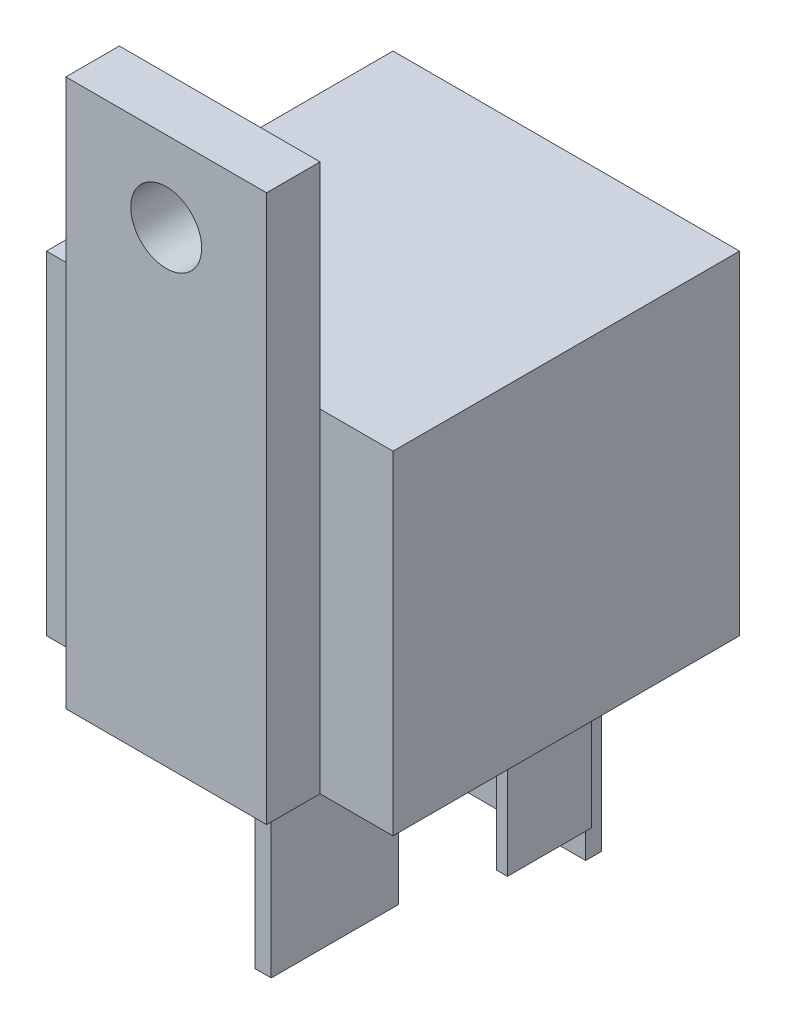
ISO-10303-21;
HEADER;
FILE_DESCRIPTION(('STEP AP214'),'2;1');
FILE_NAME('part.step','',(''),(''),'','','');
FILE_SCHEMA(('AUTOMOTIVE_DESIGN { 1 0 10303 214 1 1 1 1 }'));
ENDSEC;
DATA;
#1=APPLICATION_CONTEXT('core data for automotive mechanical design processes');
#2=APPLICATION_PROTOCOL_DEFINITION('international standard','automotive_design',2000,#1);
#3=PRODUCT_CONTEXT('',#1,'mechanical');
#4=PRODUCT('Part','Part','',(#3));
#5=PRODUCT_RELATED_PRODUCT_CATEGORY('part','',(#4));
#6=PRODUCT_DEFINITION_FORMATION('','',#4);
#7=PRODUCT_DEFINITION_CONTEXT('part definition',#1,'design');
#8=PRODUCT_DEFINITION('design','',#6,#7);
#9=PRODUCT_DEFINITION_SHAPE('','',#8);
#10=(LENGTH_UNIT() NAMED_UNIT(*) SI_UNIT(.MILLI.,.METRE.));
#11=(NAMED_UNIT(*) PLANE_ANGLE_UNIT() SI_UNIT($,.RADIAN.));
#12=(NAMED_UNIT(*) SI_UNIT($,.STERADIAN.) SOLID_ANGLE_UNIT());
#13=UNCERTAINTY_MEASURE_WITH_UNIT(LENGTH_MEASURE(1.E-05),#10,'distance_accuracy_value','');
#14=(GEOMETRIC_REPRESENTATION_CONTEXT(3) GLOBAL_UNCERTAINTY_ASSIGNED_CONTEXT((#13)) GLOBAL_UNIT_ASSIGNED_CONTEXT((#10,
#11,#12)) REPRESENTATION_CONTEXT('',''));
#15=CARTESIAN_POINT('',(0.,0.,0.));
#16=DIRECTION('',(0.,0.,1.));
#17=DIRECTION('',(1.,0.,0.));
#18=AXIS2_PLACEMENT_3D('',#15,#16,#17);
#19=CARTESIAN_POINT('',(0.,0.,0.));
#20=DIRECTION('',(0.,-1.,0.));
#21=DIRECTION('',(0.,0.,-1.));
#22=AXIS2_PLACEMENT_3D('',#19,#20,#21);
#23=PLANE('',#22);
#24=DIRECTION('',(0.,0.,1.));
#25=VECTOR('',#24,1.);
#26=CARTESIAN_POINT('',(0.,0.,0.));
#27=LINE('',#26,#25);
#28=CARTESIAN_POINT('',(0.,0.,-25.9));
#29=VERTEX_POINT('',#28);
#30=CARTESIAN_POINT('',(0.,0.,0.));
#31=VERTEX_POINT('',#30);
#32=EDGE_CURVE('E368',#29,#31,#27,.T.);
#33=ORIENTED_EDGE('',*,*,#32,.F.);
#34=DIRECTION('',(-1.,0.,0.));
#35=VECTOR('',#34,1.);
#36=CARTESIAN_POINT('',(0.,0.,-25.9));
#37=LINE('',#36,#35);
#38=CARTESIAN_POINT('',(25.9,0.,-25.9));
#39=VERTEX_POINT('',#38);
#40=EDGE_CURVE('E373',#39,#29,#37,.T.);
#41=ORIENTED_EDGE('',*,*,#40,.F.);
#42=DIRECTION('',(0.,0.,-1.));
#43=VECTOR('',#42,1.);
#44=CARTESIAN_POINT('',(25.9,0.,0.));
#45=LINE('',#44,#43);
#46=CARTESIAN_POINT('',(25.9,0.,0.));
#47=VERTEX_POINT('',#46);
#48=EDGE_CURVE('E388',#47,#39,#45,.T.);
#49=ORIENTED_EDGE('',*,*,#48,.F.);
#50=DIRECTION('',(1.,0.,0.));
#51=VECTOR('',#50,1.);
#52=CARTESIAN_POINT('',(0.,0.,0.));
#53=LINE('',#52,#51);
#54=CARTESIAN_POINT('',(20.45,0.,0.));
#55=VERTEX_POINT('',#54);
#56=EDGE_CURVE('E385',#55,#47,#53,.T.);
#57=ORIENTED_EDGE('',*,*,#56,.F.);
#58=DIRECTION('',(0.,0.,-1.));
#59=VECTOR('',#58,1.);
#60=CARTESIAN_POINT('',(20.45,0.,4.));
#61=LINE('',#60,#59);
#62=CARTESIAN_POINT('',(20.45,0.,4.));
#63=VERTEX_POINT('',#62);
#64=EDGE_CURVE('E362',#63,#55,#61,.T.);
#65=ORIENTED_EDGE('',*,*,#64,.F.);
#66=DIRECTION('',(1.,0.,0.));
#67=VECTOR('',#66,1.);
#68=CARTESIAN_POINT('',(5.45,0.,4.));
#69=LINE('',#68,#67);
#70=CARTESIAN_POINT('',(5.45,0.,4.));
#71=VERTEX_POINT('',#70);
#72=EDGE_CURVE('E343',#71,#63,#69,.T.);
#73=ORIENTED_EDGE('',*,*,#72,.F.);
#74=DIRECTION('',(0.,0.,-1.));
#75=VECTOR('',#74,1.);
#76=CARTESIAN_POINT('',(5.45,0.,4.));
#77=LINE('',#76,#75);
#78=CARTESIAN_POINT('',(5.45,0.,0.));
#79=VERTEX_POINT('',#78);
#80=EDGE_CURVE('E365',#71,#79,#77,.T.);
#81=ORIENTED_EDGE('',*,*,#80,.T.);
#82=EDGE_CURVE('E386',#31,#79,#53,.T.);
#83=ORIENTED_EDGE('',*,*,#82,.F.);
#84=EDGE_LOOP('',(#33,#41,#49,#57,#65,#73,#81,#83));
#85=FACE_BOUND('',#84,.T.);
#86=DIRECTION('',(-1.,0.,0.));
#87=VECTOR('',#86,1.);
#88=CARTESIAN_POINT('',(17.7,0.,-22.6));
#89=LINE('',#88,#87);
#90=CARTESIAN_POINT('',(17.7,0.,-22.6));
#91=VERTEX_POINT('',#90);
#92=CARTESIAN_POINT('',(8.2,0.,-22.6));
#93=VERTEX_POINT('',#92);
#94=EDGE_CURVE('E323',#91,#93,#89,.T.);
#95=ORIENTED_EDGE('',*,*,#94,.F.);
#96=DIRECTION('',(0.,0.,1.));
#97=VECTOR('',#96,1.);
#98=CARTESIAN_POINT('',(17.7,0.,-22.6));
#99=LINE('',#98,#97);
#100=CARTESIAN_POINT('',(17.7,0.,-23.8));
#101=VERTEX_POINT('',#100);
#102=EDGE_CURVE('E321',#101,#91,#99,.T.);
#103=ORIENTED_EDGE('',*,*,#102,.F.);
#104=DIRECTION('',(1.,0.,0.));
#105=VECTOR('',#104,1.);
#106=CARTESIAN_POINT('',(17.7,0.,-23.8));
#107=LINE('',#106,#105);
#108=CARTESIAN_POINT('',(8.2,0.,-23.8));
#109=VERTEX_POINT('',#108);
#110=EDGE_CURVE('E212',#109,#101,#107,.T.);
#111=ORIENTED_EDGE('',*,*,#110,.F.);
#112=DIRECTION('',(0.,0.,-1.));
#113=VECTOR('',#112,1.);
#114=CARTESIAN_POINT('',(8.2,0.,-22.6));
#115=LINE('',#114,#113);
#116=EDGE_CURVE('E325',#93,#109,#115,.T.);
#117=ORIENTED_EDGE('',*,*,#116,.F.);
#118=EDGE_LOOP('',(#95,#103,#111,#117));
#119=FACE_BOUND('',#118,.T.);
#120=DIRECTION('',(-1.,0.,0.));
#121=VECTOR('',#120,1.);
#122=CARTESIAN_POINT('',(21.8,0.,-12.65));
#123=LINE('',#122,#121);
#124=CARTESIAN_POINT('',(21.8,0.,-12.65));
#125=VERTEX_POINT('',#124);
#126=CARTESIAN_POINT('',(21.,0.,-12.65));
#127=VERTEX_POINT('',#126);
#128=EDGE_CURVE('E306',#125,#127,#123,.T.);
#129=ORIENTED_EDGE('',*,*,#128,.F.);
#130=DIRECTION('',(0.,0.,1.));
#131=VECTOR('',#130,1.);
#132=CARTESIAN_POINT('',(21.8,0.,-18.95));
#133=LINE('',#132,#131);
#134=CARTESIAN_POINT('',(21.8,0.,-18.95));
#135=VERTEX_POINT('',#134);
#136=EDGE_CURVE('E292',#135,#125,#133,.T.);
#137=ORIENTED_EDGE('',*,*,#136,.F.);
#138=DIRECTION('',(1.,0.,0.));
#139=VECTOR('',#138,1.);
#140=CARTESIAN_POINT('',(21.8,0.,-18.95));
#141=LINE('',#140,#139);
#142=CARTESIAN_POINT('',(21.,0.,-18.95));
#143=VERTEX_POINT('',#142);
#144=EDGE_CURVE('E297',#143,#135,#141,.T.);
#145=ORIENTED_EDGE('',*,*,#144,.F.);
#146=DIRECTION('',(0.,0.,-1.));
#147=VECTOR('',#146,1.);
#148=CARTESIAN_POINT('',(21.,0.,-18.95));
#149=LINE('',#148,#147);
#150=EDGE_CURVE('E308',#127,#143,#149,.T.);
#151=ORIENTED_EDGE('',*,*,#150,.F.);
#152=EDGE_LOOP('',(#129,#137,#145,#151));
#153=FACE_BOUND('',#152,.T.);
#154=DIRECTION('',(1.,0.,0.));
#155=VECTOR('',#154,1.);
#156=CARTESIAN_POINT('',(4.10000000000001,0.,-18.95));
#157=LINE('',#156,#155);
#158=CARTESIAN_POINT('',(4.10000000000001,0.,-18.95));
#159=VERTEX_POINT('',#158);
#160=CARTESIAN_POINT('',(4.90000000000001,0.,-18.95));
#161=VERTEX_POINT('',#160);
#162=EDGE_CURVE('E279',#159,#161,#157,.T.);
#163=ORIENTED_EDGE('',*,*,#162,.F.);
#164=DIRECTION('',(0.,0.,-1.));
#165=VECTOR('',#164,1.);
#166=CARTESIAN_POINT('',(4.10000000000001,0.,-18.95));
#167=LINE('',#166,#165);
#168=CARTESIAN_POINT('',(4.1,0.,-12.65));
#169=VERTEX_POINT('',#168);
#170=EDGE_CURVE('E265',#169,#159,#167,.T.);
#171=ORIENTED_EDGE('',*,*,#170,.F.);
#172=DIRECTION('',(-1.,0.,0.));
#173=VECTOR('',#172,1.);
#174=CARTESIAN_POINT('',(4.1,0.,-12.65));
#175=LINE('',#174,#173);
#176=CARTESIAN_POINT('',(4.90000000000001,0.,-12.65));
#177=VERTEX_POINT('',#176);
#178=EDGE_CURVE('E270',#177,#169,#175,.T.);
#179=ORIENTED_EDGE('',*,*,#178,.F.);
#180=DIRECTION('',(0.,0.,1.));
#181=VECTOR('',#180,1.);
#182=CARTESIAN_POINT('',(4.90000000000001,0.,-18.95));
#183=LINE('',#182,#181);
#184=EDGE_CURVE('E281',#161,#177,#183,.T.);
#185=ORIENTED_EDGE('',*,*,#184,.F.);
#186=EDGE_LOOP('',(#163,#171,#179,#185));
#187=FACE_BOUND('',#186,.T.);
#188=DIRECTION('',(-1.,0.,0.));
#189=VECTOR('',#188,1.);
#190=CARTESIAN_POINT('',(13.55,0.,-3.25));
#191=LINE('',#190,#189);
#192=CARTESIAN_POINT('',(13.55,0.,-3.25));
#193=VERTEX_POINT('',#192);
#194=CARTESIAN_POINT('',(12.35,0.,-3.25));
#195=VERTEX_POINT('',#194);
#196=EDGE_CURVE('E250',#193,#195,#191,.T.);
#197=ORIENTED_EDGE('',*,*,#196,.F.);
#198=DIRECTION('',(0.,0.,1.));
#199=VECTOR('',#198,1.);
#200=CARTESIAN_POINT('',(13.55,0.,-3.25));
#201=LINE('',#200,#199);
#202=CARTESIAN_POINT('',(13.55,0.,-12.75));
#203=VERTEX_POINT('',#202);
#204=EDGE_CURVE('E247',#203,#193,#201,.T.);
#205=ORIENTED_EDGE('',*,*,#204,.F.);
#206=DIRECTION('',(1.,0.,0.));
#207=VECTOR('',#206,1.);
#208=CARTESIAN_POINT('',(13.55,0.,-12.75));
#209=LINE('',#208,#207);
#210=CARTESIAN_POINT('',(12.35,0.,-12.75));
#211=VERTEX_POINT('',#210);
#212=EDGE_CURVE('E254',#211,#203,#209,.T.);
#213=ORIENTED_EDGE('',*,*,#212,.F.);
#214=DIRECTION('',(0.,0.,-1.));
#215=VECTOR('',#214,1.);
#216=CARTESIAN_POINT('',(12.35,0.,-3.25));
#217=LINE('',#216,#215);
#218=EDGE_CURVE('E252',#195,#211,#217,.T.);
#219=ORIENTED_EDGE('',*,*,#218,.F.);
#220=EDGE_LOOP('',(#197,#205,#213,#219));
#221=FACE_BOUND('',#220,.T.);
#222=ADVANCED_FACE('F36',(#85,#119,#153,#187,#221),#23,.T.);
#223=CARTESIAN_POINT('',(0.,24.9,0.));
#224=DIRECTION('',(0.,0.,-1.));
#225=DIRECTION('',(-1.,0.,0.));
#226=AXIS2_PLACEMENT_3D('',#223,#224,#225);
#227=PLANE('',#226);
#228=DIRECTION('',(0.,-1.,0.));
#229=VECTOR('',#228,1.);
#230=CARTESIAN_POINT('',(5.45,0.,0.));
#231=LINE('',#230,#229);
#232=CARTESIAN_POINT('',(5.45,24.9,0.));
#233=VERTEX_POINT('',#232);
#234=EDGE_CURVE('E11',#233,#79,#231,.T.);
#235=ORIENTED_EDGE('',*,*,#234,.F.);
#236=DIRECTION('',(1.,0.,0.));
#237=VECTOR('',#236,1.);
#238=CARTESIAN_POINT('',(0.,24.9,0.));
#239=LINE('',#238,#237);
#240=CARTESIAN_POINT('',(0.,24.9,0.));
#241=VERTEX_POINT('',#240);
#242=EDGE_CURVE('E374',#241,#233,#239,.T.);
#243=ORIENTED_EDGE('',*,*,#242,.F.);
#244=DIRECTION('',(0.,-1.,0.));
#245=VECTOR('',#244,1.);
#246=CARTESIAN_POINT('',(0.,24.9,0.));
#247=LINE('',#246,#245);
#248=EDGE_CURVE('E40',#241,#31,#247,.T.);
#249=ORIENTED_EDGE('',*,*,#248,.T.);
#250=ORIENTED_EDGE('',*,*,#82,.T.);
#251=EDGE_LOOP('',(#235,#243,#249,#250));
#252=FACE_BOUND('',#251,.T.);
#253=ADVANCED_FACE('F404',(#252),#227,.F.);
#254=DIRECTION('',(0.,1.,0.));
#255=VECTOR('',#254,1.);
#256=CARTESIAN_POINT('',(20.45,0.,0.));
#257=LINE('',#256,#255);
#258=CARTESIAN_POINT('',(20.45,24.9,0.));
#259=VERTEX_POINT('',#258);
#260=EDGE_CURVE('E353',#55,#259,#257,.T.);
#261=ORIENTED_EDGE('',*,*,#260,.F.);
#262=ORIENTED_EDGE('',*,*,#56,.T.);
#263=DIRECTION('',(0.,-1.,0.));
#264=VECTOR('',#263,1.);
#265=CARTESIAN_POINT('',(25.9,24.9,0.));
#266=LINE('',#265,#264);
#267=CARTESIAN_POINT('',(25.9,24.9,0.));
#268=VERTEX_POINT('',#267);
#269=EDGE_CURVE('E395',#268,#47,#266,.T.);
#270=ORIENTED_EDGE('',*,*,#269,.F.);
#271=EDGE_CURVE('E372',#259,#268,#239,.T.);
#272=ORIENTED_EDGE('',*,*,#271,.F.);
#273=EDGE_LOOP('',(#261,#262,#270,#272));
#274=FACE_BOUND('',#273,.T.);
#275=ADVANCED_FACE('F428',(#274),#227,.F.);
#276=CARTESIAN_POINT('',(0.,24.9,0.));
#277=DIRECTION('',(1.,0.,0.));
#278=DIRECTION('',(0.,0.,-1.));
#279=AXIS2_PLACEMENT_3D('',#276,#277,#278);
#280=PLANE('',#279);
#281=ORIENTED_EDGE('',*,*,#32,.T.);
#282=ORIENTED_EDGE('',*,*,#248,.F.);
#283=DIRECTION('',(0.,0.,1.));
#284=VECTOR('',#283,1.);
#285=CARTESIAN_POINT('',(0.,24.9,0.));
#286=LINE('',#285,#284);
#287=CARTESIAN_POINT('',(0.,24.9,-25.9));
#288=VERTEX_POINT('',#287);
#289=EDGE_CURVE('E369',#288,#241,#286,.T.);
#290=ORIENTED_EDGE('',*,*,#289,.F.);
#291=DIRECTION('',(0.,-1.,0.));
#292=VECTOR('',#291,1.);
#293=CARTESIAN_POINT('',(0.,24.9,-25.9));
#294=LINE('',#293,#292);
#295=EDGE_CURVE('E382',#288,#29,#294,.T.);
#296=ORIENTED_EDGE('',*,*,#295,.T.);
#297=EDGE_LOOP('',(#281,#282,#290,#296));
#298=FACE_BOUND('',#297,.T.);
#299=ADVANCED_FACE('F38',(#298),#280,.F.);
#300=CARTESIAN_POINT('',(25.9,24.9,0.));
#301=DIRECTION('',(-1.,0.,0.));
#302=DIRECTION('',(0.,0.,1.));
#303=AXIS2_PLACEMENT_3D('',#300,#301,#302);
#304=PLANE('',#303);
#305=ORIENTED_EDGE('',*,*,#48,.T.);
#306=DIRECTION('',(0.,-1.,0.));
#307=VECTOR('',#306,1.);
#308=CARTESIAN_POINT('',(25.9,24.9,-25.9));
#309=LINE('',#308,#307);
#310=CARTESIAN_POINT('',(25.9,24.9,-25.9));
#311=VERTEX_POINT('',#310);
#312=EDGE_CURVE('E393',#311,#39,#309,.T.);
#313=ORIENTED_EDGE('',*,*,#312,.F.);
#314=DIRECTION('',(0.,0.,-1.));
#315=VECTOR('',#314,1.);
#316=CARTESIAN_POINT('',(25.9,24.9,0.));
#317=LINE('',#316,#315);
#318=EDGE_CURVE('E377',#268,#311,#317,.T.);
#319=ORIENTED_EDGE('',*,*,#318,.F.);
#320=ORIENTED_EDGE('',*,*,#269,.T.);
#321=EDGE_LOOP('',(#305,#313,#319,#320));
#322=FACE_BOUND('',#321,.T.);
#323=ADVANCED_FACE('F430',(#322),#304,.F.);
#324=CARTESIAN_POINT('',(0.,24.9,-25.9));
#325=DIRECTION('',(0.,0.,1.));
#326=DIRECTION('',(1.,0.,0.));
#327=AXIS2_PLACEMENT_3D('',#324,#325,#326);
#328=PLANE('',#327);
#329=ORIENTED_EDGE('',*,*,#40,.T.);
#330=ORIENTED_EDGE('',*,*,#295,.F.);
#331=DIRECTION('',(-1.,0.,0.));
#332=VECTOR('',#331,1.);
#333=CARTESIAN_POINT('',(0.,24.9,-25.9));
#334=LINE('',#333,#332);
#335=EDGE_CURVE('E380',#311,#288,#334,.T.);
#336=ORIENTED_EDGE('',*,*,#335,.F.);
#337=ORIENTED_EDGE('',*,*,#312,.T.);
#338=EDGE_LOOP('',(#329,#330,#336,#337));
#339=FACE_BOUND('',#338,.T.);
#340=ADVANCED_FACE('F433',(#339),#328,.F.);
#341=CARTESIAN_POINT('',(0.,24.9,0.));
#342=DIRECTION('',(0.,-1.,0.));
#343=DIRECTION('',(0.,0.,-1.));
#344=AXIS2_PLACEMENT_3D('',#341,#342,#343);
#345=PLANE('',#344);
#346=ORIENTED_EDGE('',*,*,#289,.T.);
#347=ORIENTED_EDGE('',*,*,#242,.T.);
#348=EDGE_CURVE('E378',#233,#259,#239,.T.);
#349=ORIENTED_EDGE('',*,*,#348,.T.);
#350=ORIENTED_EDGE('',*,*,#271,.T.);
#351=ORIENTED_EDGE('',*,*,#318,.T.);
#352=ORIENTED_EDGE('',*,*,#335,.T.);
#353=EDGE_LOOP('',(#346,#347,#349,#350,#351,#352));
#354=FACE_BOUND('',#353,.T.);
#355=ADVANCED_FACE('F420',(#354),#345,.F.);
#356=CARTESIAN_POINT('',(0.,0.,0.));
#357=DIRECTION('',(0.,0.,-1.));
#358=DIRECTION('',(-1.,0.,0.));
#359=AXIS2_PLACEMENT_3D('',#356,#357,#358);
#360=PLANE('',#359);
#361=CARTESIAN_POINT('',(12.95,34.9,0.));
#362=DIRECTION('',(0.,0.,1.));
#363=DIRECTION('',(1.,0.,0.));
#364=AXIS2_PLACEMENT_3D('',#361,#362,#363);
#365=CIRCLE('',#364,2.65);
#366=CARTESIAN_POINT('',(15.6,34.9,0.));
#367=VERTEX_POINT('',#366);
#368=EDGE_CURVE('E334',#367,#367,#365,.T.);
#369=ORIENTED_EDGE('',*,*,#368,.T.);
#370=EDGE_LOOP('',(#369));
#371=FACE_BOUND('',#370,.T.);
#372=ORIENTED_EDGE('',*,*,#348,.F.);
#373=CARTESIAN_POINT('',(5.45,40.9,0.));
#374=VERTEX_POINT('',#373);
#375=EDGE_CURVE('E46',#374,#233,#231,.T.);
#376=ORIENTED_EDGE('',*,*,#375,.F.);
#377=DIRECTION('',(-1.,0.,0.));
#378=VECTOR('',#377,1.);
#379=CARTESIAN_POINT('',(5.45,40.9,0.));
#380=LINE('',#379,#378);
#381=CARTESIAN_POINT('',(20.45,40.9,0.));
#382=VERTEX_POINT('',#381);
#383=EDGE_CURVE('E344',#382,#374,#380,.T.);
#384=ORIENTED_EDGE('',*,*,#383,.F.);
#385=EDGE_CURVE('E352',#259,#382,#257,.T.);
#386=ORIENTED_EDGE('',*,*,#385,.F.);
#387=EDGE_LOOP('',(#372,#376,#384,#386));
#388=FACE_BOUND('',#387,.T.);
#389=ADVANCED_FACE('F424',(#371,#388),#360,.T.);
#390=CARTESIAN_POINT('',(0.,0.,4.));
#391=DIRECTION('',(0.,0.,-1.));
#392=DIRECTION('',(-1.,0.,0.));
#393=AXIS2_PLACEMENT_3D('',#390,#391,#392);
#394=PLANE('',#393);
#395=DIRECTION('',(0.,-1.,0.));
#396=VECTOR('',#395,1.);
#397=CARTESIAN_POINT('',(5.45,0.,4.));
#398=LINE('',#397,#396);
#399=CARTESIAN_POINT('',(5.45,40.9,4.));
#400=VERTEX_POINT('',#399);
#401=EDGE_CURVE('E340',#400,#71,#398,.T.);
#402=ORIENTED_EDGE('',*,*,#401,.T.);
#403=ORIENTED_EDGE('',*,*,#72,.T.);
#404=DIRECTION('',(0.,1.,0.));
#405=VECTOR('',#404,1.);
#406=CARTESIAN_POINT('',(20.45,0.,4.));
#407=LINE('',#406,#405);
#408=CARTESIAN_POINT('',(20.45,40.9,4.));
#409=VERTEX_POINT('',#408);
#410=EDGE_CURVE('E346',#63,#409,#407,.T.);
#411=ORIENTED_EDGE('',*,*,#410,.T.);
#412=DIRECTION('',(-1.,0.,0.));
#413=VECTOR('',#412,1.);
#414=CARTESIAN_POINT('',(5.45,40.9,4.));
#415=LINE('',#414,#413);
#416=EDGE_CURVE('E348',#409,#400,#415,.T.);
#417=ORIENTED_EDGE('',*,*,#416,.T.);
#418=EDGE_LOOP('',(#402,#403,#411,#417));
#419=FACE_BOUND('',#418,.T.);
#420=CARTESIAN_POINT('',(12.95,34.9,4.));
#421=DIRECTION('',(0.,0.,1.));
#422=DIRECTION('',(1.,0.,0.));
#423=AXIS2_PLACEMENT_3D('',#420,#421,#422);
#424=CIRCLE('',#423,2.65);
#425=CARTESIAN_POINT('',(15.6,34.9,4.));
#426=VERTEX_POINT('',#425);
#427=EDGE_CURVE('E335',#426,#426,#424,.T.);
#428=ORIENTED_EDGE('',*,*,#427,.F.);
#429=EDGE_LOOP('',(#428));
#430=FACE_BOUND('',#429,.T.);
#431=ADVANCED_FACE('F451',(#419,#430),#394,.F.);
#432=CARTESIAN_POINT('',(5.45,0.,4.));
#433=DIRECTION('',(1.,0.,0.));
#434=DIRECTION('',(0.,0.,-1.));
#435=AXIS2_PLACEMENT_3D('',#432,#433,#434);
#436=PLANE('',#435);
#437=ORIENTED_EDGE('',*,*,#375,.T.);
#438=ORIENTED_EDGE('',*,*,#234,.T.);
#439=ORIENTED_EDGE('',*,*,#80,.F.);
#440=ORIENTED_EDGE('',*,*,#401,.F.);
#441=DIRECTION('',(0.,0.,-1.));
#442=VECTOR('',#441,1.);
#443=CARTESIAN_POINT('',(5.45,40.9,4.));
#444=LINE('',#443,#442);
#445=EDGE_CURVE('E349',#400,#374,#444,.T.);
#446=ORIENTED_EDGE('',*,*,#445,.T.);
#447=EDGE_LOOP('',(#437,#438,#439,#440,#446));
#448=FACE_BOUND('',#447,.T.);
#449=ADVANCED_FACE('F416',(#448),#436,.F.);
#450=CARTESIAN_POINT('',(20.45,0.,4.));
#451=DIRECTION('',(-1.,0.,0.));
#452=DIRECTION('',(0.,-1.,0.));
#453=AXIS2_PLACEMENT_3D('',#450,#451,#452);
#454=PLANE('',#453);
#455=ORIENTED_EDGE('',*,*,#260,.T.);
#456=ORIENTED_EDGE('',*,*,#385,.T.);
#457=DIRECTION('',(0.,0.,-1.));
#458=VECTOR('',#457,1.);
#459=CARTESIAN_POINT('',(20.45,40.9,4.));
#460=LINE('',#459,#458);
#461=EDGE_CURVE('E359',#409,#382,#460,.T.);
#462=ORIENTED_EDGE('',*,*,#461,.F.);
#463=ORIENTED_EDGE('',*,*,#410,.F.);
#464=ORIENTED_EDGE('',*,*,#64,.T.);
#465=EDGE_LOOP('',(#455,#456,#462,#463,#464));
#466=FACE_BOUND('',#465,.T.);
#467=ADVANCED_FACE('F450',(#466),#454,.F.);
#468=CARTESIAN_POINT('',(5.45,40.9,4.));
#469=DIRECTION('',(0.,-1.,0.));
#470=DIRECTION('',(1.,0.,0.));
#471=AXIS2_PLACEMENT_3D('',#468,#469,#470);
#472=PLANE('',#471);
#473=ORIENTED_EDGE('',*,*,#383,.T.);
#474=ORIENTED_EDGE('',*,*,#445,.F.);
#475=ORIENTED_EDGE('',*,*,#416,.F.);
#476=ORIENTED_EDGE('',*,*,#461,.T.);
#477=EDGE_LOOP('',(#473,#474,#475,#476));
#478=FACE_BOUND('',#477,.T.);
#479=ADVANCED_FACE('F454',(#478),#472,.F.);
#480=CARTESIAN_POINT('',(12.95,34.9,4.));
#481=DIRECTION('',(0.,0.,-1.));
#482=DIRECTION('',(-1.,0.,0.));
#483=AXIS2_PLACEMENT_3D('',#480,#481,#482);
#484=CYLINDRICAL_SURFACE('',#483,2.65);
#485=ORIENTED_EDGE('',*,*,#427,.T.);
#486=EDGE_LOOP('',(#485));
#487=FACE_BOUND('',#486,.T.);
#488=ORIENTED_EDGE('',*,*,#368,.F.);
#489=EDGE_LOOP('',(#488));
#490=FACE_BOUND('',#489,.T.);
#491=ADVANCED_FACE('F458',(#487,#490),#484,.F.);
#492=CARTESIAN_POINT('',(17.7,-11.,-22.6));
#493=DIRECTION('',(-1.,0.,0.));
#494=DIRECTION('',(0.,0.,1.));
#495=AXIS2_PLACEMENT_3D('',#492,#493,#494);
#496=PLANE('',#495);
#497=ORIENTED_EDGE('',*,*,#102,.T.);
#498=DIRECTION('',(0.,1.,0.));
#499=VECTOR('',#498,1.);
#500=CARTESIAN_POINT('',(17.7,-11.,-22.6));
#501=LINE('',#500,#499);
#502=CARTESIAN_POINT('',(17.7,-17.,-22.6));
#503=VERTEX_POINT('',#502);
#504=EDGE_CURVE('E221',#503,#91,#501,.T.);
#505=ORIENTED_EDGE('',*,*,#504,.F.);
#506=DIRECTION('',(0.,0.,1.));
#507=VECTOR('',#506,1.);
#508=CARTESIAN_POINT('',(17.7,-17.,-23.8));
#509=LINE('',#508,#507);
#510=CARTESIAN_POINT('',(17.7,-17.,-23.8));
#511=VERTEX_POINT('',#510);
#512=EDGE_CURVE('E219',#511,#503,#509,.T.);
#513=ORIENTED_EDGE('',*,*,#512,.F.);
#514=DIRECTION('',(0.,1.,0.));
#515=VECTOR('',#514,1.);
#516=CARTESIAN_POINT('',(17.7,-11.,-23.8));
#517=LINE('',#516,#515);
#518=EDGE_CURVE('E206',#511,#101,#517,.T.);
#519=ORIENTED_EDGE('',*,*,#518,.T.);
#520=EDGE_LOOP('',(#497,#505,#513,#519));
#521=FACE_BOUND('',#520,.T.);
#522=ADVANCED_FACE('F220',(#521),#496,.F.);
#523=CARTESIAN_POINT('',(17.7,-11.,-22.6));
#524=DIRECTION('',(0.,0.,-1.));
#525=DIRECTION('',(-1.,0.,0.));
#526=AXIS2_PLACEMENT_3D('',#523,#524,#525);
#527=PLANE('',#526);
#528=ORIENTED_EDGE('',*,*,#94,.T.);
#529=DIRECTION('',(0.,1.,0.));
#530=VECTOR('',#529,1.);
#531=CARTESIAN_POINT('',(8.2,-11.,-22.6));
#532=LINE('',#531,#530);
#533=CARTESIAN_POINT('',(8.2,-17.,-22.6));
#534=VERTEX_POINT('',#533);
#535=EDGE_CURVE('E330',#534,#93,#532,.T.);
#536=ORIENTED_EDGE('',*,*,#535,.F.);
#537=DIRECTION('',(-1.,0.,0.));
#538=VECTOR('',#537,1.);
#539=CARTESIAN_POINT('',(17.7,-17.,-22.6));
#540=LINE('',#539,#538);
#541=EDGE_CURVE('E225',#503,#534,#540,.T.);
#542=ORIENTED_EDGE('',*,*,#541,.F.);
#543=ORIENTED_EDGE('',*,*,#504,.T.);
#544=EDGE_LOOP('',(#528,#536,#542,#543));
#545=FACE_BOUND('',#544,.T.);
#546=ADVANCED_FACE('F471',(#545),#527,.F.);
#547=CARTESIAN_POINT('',(8.2,-11.,-22.6));
#548=DIRECTION('',(1.,0.,0.));
#549=DIRECTION('',(0.,0.,-1.));
#550=AXIS2_PLACEMENT_3D('',#547,#548,#549);
#551=PLANE('',#550);
#552=ORIENTED_EDGE('',*,*,#116,.T.);
#553=DIRECTION('',(0.,1.,0.));
#554=VECTOR('',#553,1.);
#555=CARTESIAN_POINT('',(8.2,-11.,-23.8));
#556=LINE('',#555,#554);
#557=CARTESIAN_POINT('',(8.2,-17.,-23.8));
#558=VERTEX_POINT('',#557);
#559=EDGE_CURVE('E216',#558,#109,#556,.T.);
#560=ORIENTED_EDGE('',*,*,#559,.F.);
#561=DIRECTION('',(0.,0.,-1.));
#562=VECTOR('',#561,1.);
#563=CARTESIAN_POINT('',(8.2,-17.,-22.6));
#564=LINE('',#563,#562);
#565=EDGE_CURVE('E230',#534,#558,#564,.T.);
#566=ORIENTED_EDGE('',*,*,#565,.F.);
#567=ORIENTED_EDGE('',*,*,#535,.T.);
#568=EDGE_LOOP('',(#552,#560,#566,#567));
#569=FACE_BOUND('',#568,.T.);
#570=ADVANCED_FACE('F474',(#569),#551,.F.);
#571=CARTESIAN_POINT('',(17.7,-11.,-23.8));
#572=DIRECTION('',(0.,0.,1.));
#573=DIRECTION('',(1.,0.,0.));
#574=AXIS2_PLACEMENT_3D('',#571,#572,#573);
#575=PLANE('',#574);
#576=ORIENTED_EDGE('',*,*,#110,.T.);
#577=ORIENTED_EDGE('',*,*,#518,.F.);
#578=DIRECTION('',(1.,0.,0.));
#579=VECTOR('',#578,1.);
#580=CARTESIAN_POINT('',(8.2,-17.,-23.8));
#581=LINE('',#580,#579);
#582=EDGE_CURVE('E210',#558,#511,#581,.T.);
#583=ORIENTED_EDGE('',*,*,#582,.F.);
#584=ORIENTED_EDGE('',*,*,#559,.T.);
#585=EDGE_LOOP('',(#576,#577,#583,#584));
#586=FACE_BOUND('',#585,.T.);
#587=ADVANCED_FACE('F208',(#586),#575,.F.);
#588=CARTESIAN_POINT('',(21.8,-11.,-18.95));
#589=DIRECTION('',(-1.,0.,0.));
#590=DIRECTION('',(0.,0.,1.));
#591=AXIS2_PLACEMENT_3D('',#588,#589,#590);
#592=PLANE('',#591);
#593=ORIENTED_EDGE('',*,*,#136,.T.);
#594=DIRECTION('',(0.,1.,0.));
#595=VECTOR('',#594,1.);
#596=CARTESIAN_POINT('',(21.8,-11.,-12.65));
#597=LINE('',#596,#595);
#598=CARTESIAN_POINT('',(21.8,-11.,-12.65));
#599=VERTEX_POINT('',#598);
#600=EDGE_CURVE('E319',#599,#125,#597,.T.);
#601=ORIENTED_EDGE('',*,*,#600,.F.);
#602=DIRECTION('',(0.,0.,1.));
#603=VECTOR('',#602,1.);
#604=CARTESIAN_POINT('',(21.8,-11.,-18.95));
#605=LINE('',#604,#603);
#606=CARTESIAN_POINT('',(21.8,-11.,-18.95));
#607=VERTEX_POINT('',#606);
#608=EDGE_CURVE('E293',#607,#599,#605,.T.);
#609=ORIENTED_EDGE('',*,*,#608,.F.);
#610=DIRECTION('',(0.,1.,0.));
#611=VECTOR('',#610,1.);
#612=CARTESIAN_POINT('',(21.8,-11.,-18.95));
#613=LINE('',#612,#611);
#614=EDGE_CURVE('E303',#607,#135,#613,.T.);
#615=ORIENTED_EDGE('',*,*,#614,.T.);
#616=EDGE_LOOP('',(#593,#601,#609,#615));
#617=FACE_BOUND('',#616,.T.);
#618=ADVANCED_FACE('F481',(#617),#592,.F.);
#619=CARTESIAN_POINT('',(21.8,-11.,-12.65));
#620=DIRECTION('',(0.,0.,-1.));
#621=DIRECTION('',(-1.,0.,0.));
#622=AXIS2_PLACEMENT_3D('',#619,#620,#621);
#623=PLANE('',#622);
#624=ORIENTED_EDGE('',*,*,#128,.T.);
#625=DIRECTION('',(0.,1.,0.));
#626=VECTOR('',#625,1.);
#627=CARTESIAN_POINT('',(21.,-11.,-12.65));
#628=LINE('',#627,#626);
#629=CARTESIAN_POINT('',(21.,-11.,-12.65));
#630=VERTEX_POINT('',#629);
#631=EDGE_CURVE('E316',#630,#127,#628,.T.);
#632=ORIENTED_EDGE('',*,*,#631,.F.);
#633=DIRECTION('',(-1.,0.,0.));
#634=VECTOR('',#633,1.);
#635=CARTESIAN_POINT('',(21.8,-11.,-12.65));
#636=LINE('',#635,#634);
#637=EDGE_CURVE('E296',#599,#630,#636,.T.);
#638=ORIENTED_EDGE('',*,*,#637,.F.);
#639=ORIENTED_EDGE('',*,*,#600,.T.);
#640=EDGE_LOOP('',(#624,#632,#638,#639));
#641=FACE_BOUND('',#640,.T.);
#642=ADVANCED_FACE('F484',(#641),#623,.F.);
#643=CARTESIAN_POINT('',(21.,-11.,-18.95));
#644=DIRECTION('',(1.,0.,0.));
#645=DIRECTION('',(0.,0.,-1.));
#646=AXIS2_PLACEMENT_3D('',#643,#644,#645);
#647=PLANE('',#646);
#648=ORIENTED_EDGE('',*,*,#150,.T.);
#649=DIRECTION('',(0.,1.,0.));
#650=VECTOR('',#649,1.);
#651=CARTESIAN_POINT('',(21.,-11.,-18.95));
#652=LINE('',#651,#650);
#653=CARTESIAN_POINT('',(21.,-11.,-18.95));
#654=VERTEX_POINT('',#653);
#655=EDGE_CURVE('E314',#654,#143,#652,.T.);
#656=ORIENTED_EDGE('',*,*,#655,.F.);
#657=DIRECTION('',(0.,0.,-1.));
#658=VECTOR('',#657,1.);
#659=CARTESIAN_POINT('',(21.,-11.,-18.95));
#660=LINE('',#659,#658);
#661=EDGE_CURVE('E299',#630,#654,#660,.T.);
#662=ORIENTED_EDGE('',*,*,#661,.F.);
#663=ORIENTED_EDGE('',*,*,#631,.T.);
#664=EDGE_LOOP('',(#648,#656,#662,#663));
#665=FACE_BOUND('',#664,.T.);
#666=ADVANCED_FACE('F488',(#665),#647,.F.);
#667=CARTESIAN_POINT('',(21.8,-11.,-18.95));
#668=DIRECTION('',(0.,0.,1.));
#669=DIRECTION('',(1.,0.,0.));
#670=AXIS2_PLACEMENT_3D('',#667,#668,#669);
#671=PLANE('',#670);
#672=ORIENTED_EDGE('',*,*,#144,.T.);
#673=ORIENTED_EDGE('',*,*,#614,.F.);
#674=DIRECTION('',(1.,0.,0.));
#675=VECTOR('',#674,1.);
#676=CARTESIAN_POINT('',(21.8,-11.,-18.95));
#677=LINE('',#676,#675);
#678=EDGE_CURVE('E301',#654,#607,#677,.T.);
#679=ORIENTED_EDGE('',*,*,#678,.F.);
#680=ORIENTED_EDGE('',*,*,#655,.T.);
#681=EDGE_LOOP('',(#672,#673,#679,#680));
#682=FACE_BOUND('',#681,.T.);
#683=ADVANCED_FACE('F492',(#682),#671,.F.);
#684=CARTESIAN_POINT('',(0.,-11.,0.));
#685=DIRECTION('',(0.,-1.,0.));
#686=DIRECTION('',(0.,0.,-1.));
#687=AXIS2_PLACEMENT_3D('',#684,#685,#686);
#688=PLANE('',#687);
#689=ORIENTED_EDGE('',*,*,#608,.T.);
#690=ORIENTED_EDGE('',*,*,#637,.T.);
#691=ORIENTED_EDGE('',*,*,#661,.T.);
#692=ORIENTED_EDGE('',*,*,#678,.T.);
#693=EDGE_LOOP('',(#689,#690,#691,#692));
#694=FACE_BOUND('',#693,.T.);
#695=ADVANCED_FACE('F496',(#694),#688,.T.);
#696=CARTESIAN_POINT('',(4.10000000000001,-11.,-18.95));
#697=DIRECTION('',(1.,0.,0.));
#698=DIRECTION('',(0.,0.,-1.));
#699=AXIS2_PLACEMENT_3D('',#696,#697,#698);
#700=PLANE('',#699);
#701=ORIENTED_EDGE('',*,*,#170,.T.);
#702=DIRECTION('',(0.,1.,0.));
#703=VECTOR('',#702,1.);
#704=CARTESIAN_POINT('',(4.10000000000001,-11.,-18.95));
#705=LINE('',#704,#703);
#706=CARTESIAN_POINT('',(4.10000000000001,-11.,-18.95));
#707=VERTEX_POINT('',#706);
#708=EDGE_CURVE('E290',#707,#159,#705,.T.);
#709=ORIENTED_EDGE('',*,*,#708,.F.);
#710=DIRECTION('',(0.,0.,-1.));
#711=VECTOR('',#710,1.);
#712=CARTESIAN_POINT('',(4.10000000000001,-11.,-18.95));
#713=LINE('',#712,#711);
#714=CARTESIAN_POINT('',(4.1,-11.,-12.65));
#715=VERTEX_POINT('',#714);
#716=EDGE_CURVE('E266',#715,#707,#713,.T.);
#717=ORIENTED_EDGE('',*,*,#716,.F.);
#718=DIRECTION('',(0.,1.,0.));
#719=VECTOR('',#718,1.);
#720=CARTESIAN_POINT('',(4.1,-11.,-12.65));
#721=LINE('',#720,#719);
#722=EDGE_CURVE('E276',#715,#169,#721,.T.);
#723=ORIENTED_EDGE('',*,*,#722,.T.);
#724=EDGE_LOOP('',(#701,#709,#717,#723));
#725=FACE_BOUND('',#724,.T.);
#726=ADVANCED_FACE('F500',(#725),#700,.F.);
#727=CARTESIAN_POINT('',(4.10000000000001,-11.,-18.95));
#728=DIRECTION('',(0.,0.,1.));
#729=DIRECTION('',(1.,0.,0.));
#730=AXIS2_PLACEMENT_3D('',#727,#728,#729);
#731=PLANE('',#730);
#732=ORIENTED_EDGE('',*,*,#162,.T.);
#733=DIRECTION('',(0.,1.,0.));
#734=VECTOR('',#733,1.);
#735=CARTESIAN_POINT('',(4.90000000000001,-11.,-18.95));
#736=LINE('',#735,#734);
#737=CARTESIAN_POINT('',(4.90000000000001,-11.,-18.95));
#738=VERTEX_POINT('',#737);
#739=EDGE_CURVE('E287',#738,#161,#736,.T.);
#740=ORIENTED_EDGE('',*,*,#739,.F.);
#741=DIRECTION('',(1.,0.,0.));
#742=VECTOR('',#741,1.);
#743=CARTESIAN_POINT('',(4.10000000000001,-11.,-18.95));
#744=LINE('',#743,#742);
#745=EDGE_CURVE('E269',#707,#738,#744,.T.);
#746=ORIENTED_EDGE('',*,*,#745,.F.);
#747=ORIENTED_EDGE('',*,*,#708,.T.);
#748=EDGE_LOOP('',(#732,#740,#746,#747));
#749=FACE_BOUND('',#748,.T.);
#750=ADVANCED_FACE('F504',(#749),#731,.F.);
#751=CARTESIAN_POINT('',(4.90000000000001,-11.,-18.95));
#752=DIRECTION('',(-1.,0.,0.));
#753=DIRECTION('',(0.,0.,1.));
#754=AXIS2_PLACEMENT_3D('',#751,#752,#753);
#755=PLANE('',#754);
#756=ORIENTED_EDGE('',*,*,#184,.T.);
#757=DIRECTION('',(0.,1.,0.));
#758=VECTOR('',#757,1.);
#759=CARTESIAN_POINT('',(4.90000000000001,-11.,-12.65));
#760=LINE('',#759,#758);
#761=CARTESIAN_POINT('',(4.90000000000001,-11.,-12.65));
#762=VERTEX_POINT('',#761);
#763=EDGE_CURVE('E61',#762,#177,#760,.T.);
#764=ORIENTED_EDGE('',*,*,#763,.F.);
#765=DIRECTION('',(0.,0.,1.));
#766=VECTOR('',#765,1.);
#767=CARTESIAN_POINT('',(4.90000000000001,-11.,-18.95));
#768=LINE('',#767,#766);
#769=EDGE_CURVE('E272',#738,#762,#768,.T.);
#770=ORIENTED_EDGE('',*,*,#769,.F.);
#771=ORIENTED_EDGE('',*,*,#739,.T.);
#772=EDGE_LOOP('',(#756,#764,#770,#771));
#773=FACE_BOUND('',#772,.T.);
#774=ADVANCED_FACE('F508',(#773),#755,.F.);
#775=CARTESIAN_POINT('',(4.1,-11.,-12.65));
#776=DIRECTION('',(0.,0.,-1.));
#777=DIRECTION('',(-1.,0.,0.));
#778=AXIS2_PLACEMENT_3D('',#775,#776,#777);
#779=PLANE('',#778);
#780=ORIENTED_EDGE('',*,*,#178,.T.);
#781=ORIENTED_EDGE('',*,*,#722,.F.);
#782=DIRECTION('',(-1.,0.,0.));
#783=VECTOR('',#782,1.);
#784=CARTESIAN_POINT('',(4.1,-11.,-12.65));
#785=LINE('',#784,#783);
#786=EDGE_CURVE('E274',#762,#715,#785,.T.);
#787=ORIENTED_EDGE('',*,*,#786,.F.);
#788=ORIENTED_EDGE('',*,*,#763,.T.);
#789=EDGE_LOOP('',(#780,#781,#787,#788));
#790=FACE_BOUND('',#789,.T.);
#791=ADVANCED_FACE('F512',(#790),#779,.F.);
#792=CARTESIAN_POINT('',(0.,-11.,0.));
#793=DIRECTION('',(0.,1.,0.));
#794=DIRECTION('',(0.,0.,1.));
#795=AXIS2_PLACEMENT_3D('',#792,#793,#794);
#796=PLANE('',#795);
#797=ORIENTED_EDGE('',*,*,#716,.T.);
#798=ORIENTED_EDGE('',*,*,#745,.T.);
#799=ORIENTED_EDGE('',*,*,#769,.T.);
#800=ORIENTED_EDGE('',*,*,#786,.T.);
#801=EDGE_LOOP('',(#797,#798,#799,#800));
#802=FACE_BOUND('',#801,.T.);
#803=ADVANCED_FACE('F516',(#802),#796,.F.);
#804=CARTESIAN_POINT('',(13.55,-11.,-3.25));
#805=DIRECTION('',(-1.,0.,0.));
#806=DIRECTION('',(0.,0.,1.));
#807=AXIS2_PLACEMENT_3D('',#804,#805,#806);
#808=PLANE('',#807);
#809=ORIENTED_EDGE('',*,*,#204,.T.);
#810=DIRECTION('',(0.,1.,0.));
#811=VECTOR('',#810,1.);
#812=CARTESIAN_POINT('',(13.55,-11.,-3.25));
#813=LINE('',#812,#811);
#814=CARTESIAN_POINT('',(13.55,-17.,-3.25));
#815=VERTEX_POINT('',#814);
#816=EDGE_CURVE('E263',#815,#193,#813,.T.);
#817=ORIENTED_EDGE('',*,*,#816,.F.);
#818=DIRECTION('',(0.,0.,1.));
#819=VECTOR('',#818,1.);
#820=CARTESIAN_POINT('',(13.55,-17.,-12.75));
#821=LINE('',#820,#819);
#822=CARTESIAN_POINT('',(13.55,-17.,-12.75));
#823=VERTEX_POINT('',#822);
#824=EDGE_CURVE('E238',#823,#815,#821,.T.);
#825=ORIENTED_EDGE('',*,*,#824,.F.);
#826=DIRECTION('',(0.,1.,0.));
#827=VECTOR('',#826,1.);
#828=CARTESIAN_POINT('',(13.55,-11.,-12.75));
#829=LINE('',#828,#827);
#830=EDGE_CURVE('E256',#823,#203,#829,.T.);
#831=ORIENTED_EDGE('',*,*,#830,.T.);
#832=EDGE_LOOP('',(#809,#817,#825,#831));
#833=FACE_BOUND('',#832,.T.);
#834=ADVANCED_FACE('F519',(#833),#808,.F.);
#835=CARTESIAN_POINT('',(13.55,-11.,-3.25));
#836=DIRECTION('',(0.,0.,-1.));
#837=DIRECTION('',(-1.,0.,0.));
#838=AXIS2_PLACEMENT_3D('',#835,#836,#837);
#839=PLANE('',#838);
#840=ORIENTED_EDGE('',*,*,#196,.T.);
#841=DIRECTION('',(0.,1.,0.));
#842=VECTOR('',#841,1.);
#843=CARTESIAN_POINT('',(12.35,-11.,-3.25));
#844=LINE('',#843,#842);
#845=CARTESIAN_POINT('',(12.35,-17.,-3.25));
#846=VERTEX_POINT('',#845);
#847=EDGE_CURVE('E260',#846,#195,#844,.T.);
#848=ORIENTED_EDGE('',*,*,#847,.F.);
#849=DIRECTION('',(-1.,0.,0.));
#850=VECTOR('',#849,1.);
#851=CARTESIAN_POINT('',(13.55,-17.,-3.25));
#852=LINE('',#851,#850);
#853=EDGE_CURVE('E241',#815,#846,#852,.T.);
#854=ORIENTED_EDGE('',*,*,#853,.F.);
#855=ORIENTED_EDGE('',*,*,#816,.T.);
#856=EDGE_LOOP('',(#840,#848,#854,#855));
#857=FACE_BOUND('',#856,.T.);
#858=ADVANCED_FACE('F523',(#857),#839,.F.);
#859=CARTESIAN_POINT('',(12.35,-11.,-3.25));
#860=DIRECTION('',(1.,0.,0.));
#861=DIRECTION('',(0.,0.,-1.));
#862=AXIS2_PLACEMENT_3D('',#859,#860,#861);
#863=PLANE('',#862);
#864=ORIENTED_EDGE('',*,*,#218,.T.);
#865=DIRECTION('',(0.,1.,0.));
#866=VECTOR('',#865,1.);
#867=CARTESIAN_POINT('',(12.35,-11.,-12.75));
#868=LINE('',#867,#866);
#869=CARTESIAN_POINT('',(12.35,-17.,-12.75));
#870=VERTEX_POINT('',#869);
#871=EDGE_CURVE('E53',#870,#211,#868,.T.);
#872=ORIENTED_EDGE('',*,*,#871,.F.);
#873=DIRECTION('',(0.,0.,-1.));
#874=VECTOR('',#873,1.);
#875=CARTESIAN_POINT('',(12.35,-17.,-3.25));
#876=LINE('',#875,#874);
#877=EDGE_CURVE('E244',#846,#870,#876,.T.);
#878=ORIENTED_EDGE('',*,*,#877,.F.);
#879=ORIENTED_EDGE('',*,*,#847,.T.);
#880=EDGE_LOOP('',(#864,#872,#878,#879));
#881=FACE_BOUND('',#880,.T.);
#882=ADVANCED_FACE('F527',(#881),#863,.F.);
#883=CARTESIAN_POINT('',(13.55,-11.,-12.75));
#884=DIRECTION('',(0.,0.,1.));
#885=DIRECTION('',(1.,0.,0.));
#886=AXIS2_PLACEMENT_3D('',#883,#884,#885);
#887=PLANE('',#886);
#888=ORIENTED_EDGE('',*,*,#212,.T.);
#889=ORIENTED_EDGE('',*,*,#830,.F.);
#890=DIRECTION('',(1.,0.,0.));
#891=VECTOR('',#890,1.);
#892=CARTESIAN_POINT('',(12.35,-17.,-12.75));
#893=LINE('',#892,#891);
#894=EDGE_CURVE('E235',#870,#823,#893,.T.);
#895=ORIENTED_EDGE('',*,*,#894,.F.);
#896=ORIENTED_EDGE('',*,*,#871,.T.);
#897=EDGE_LOOP('',(#888,#889,#895,#896));
#898=FACE_BOUND('',#897,.T.);
#899=ADVANCED_FACE('F531',(#898),#887,.F.);
#900=CARTESIAN_POINT('',(0.,-17.,0.));
#901=DIRECTION('',(0.,-1.,0.));
#902=DIRECTION('',(0.,0.,-1.));
#903=AXIS2_PLACEMENT_3D('',#900,#901,#902);
#904=PLANE('',#903);
#905=ORIENTED_EDGE('',*,*,#894,.T.);
#906=ORIENTED_EDGE('',*,*,#824,.T.);
#907=ORIENTED_EDGE('',*,*,#853,.T.);
#908=ORIENTED_EDGE('',*,*,#877,.T.);
#909=EDGE_LOOP('',(#905,#906,#907,#908));
#910=FACE_BOUND('',#909,.T.);
#911=ADVANCED_FACE('F535',(#910),#904,.T.);
#912=CARTESIAN_POINT('',(0.,-17.,0.));
#913=DIRECTION('',(0.,-1.,0.));
#914=DIRECTION('',(0.,0.,-1.));
#915=AXIS2_PLACEMENT_3D('',#912,#913,#914);
#916=PLANE('',#915);
#917=ORIENTED_EDGE('',*,*,#582,.T.);
#918=ORIENTED_EDGE('',*,*,#512,.T.);
#919=ORIENTED_EDGE('',*,*,#541,.T.);
#920=ORIENTED_EDGE('',*,*,#565,.T.);
#921=EDGE_LOOP('',(#917,#918,#919,#920));
#922=FACE_BOUND('',#921,.T.);
#923=ADVANCED_FACE('F228',(#922),#916,.T.);
#924=CLOSED_SHELL('',(#222,#253,#275,#299,#323,#340,#355,#389,#431,#449,#467,#479,#491,#522,
#546,#570,#587,#618,#642,#666,#683,#695,#726,#750,#774,#791,#803,#834,#858,#882,#899,#911,#923));
#925=MANIFOLD_SOLID_BREP('B2',#924);
#926=ADVANCED_BREP_SHAPE_REPRESENTATION('',(#18,#925),#14);
#927=SHAPE_DEFINITION_REPRESENTATION(#9,#926);
ENDSEC;
END-ISO-10303-21;
